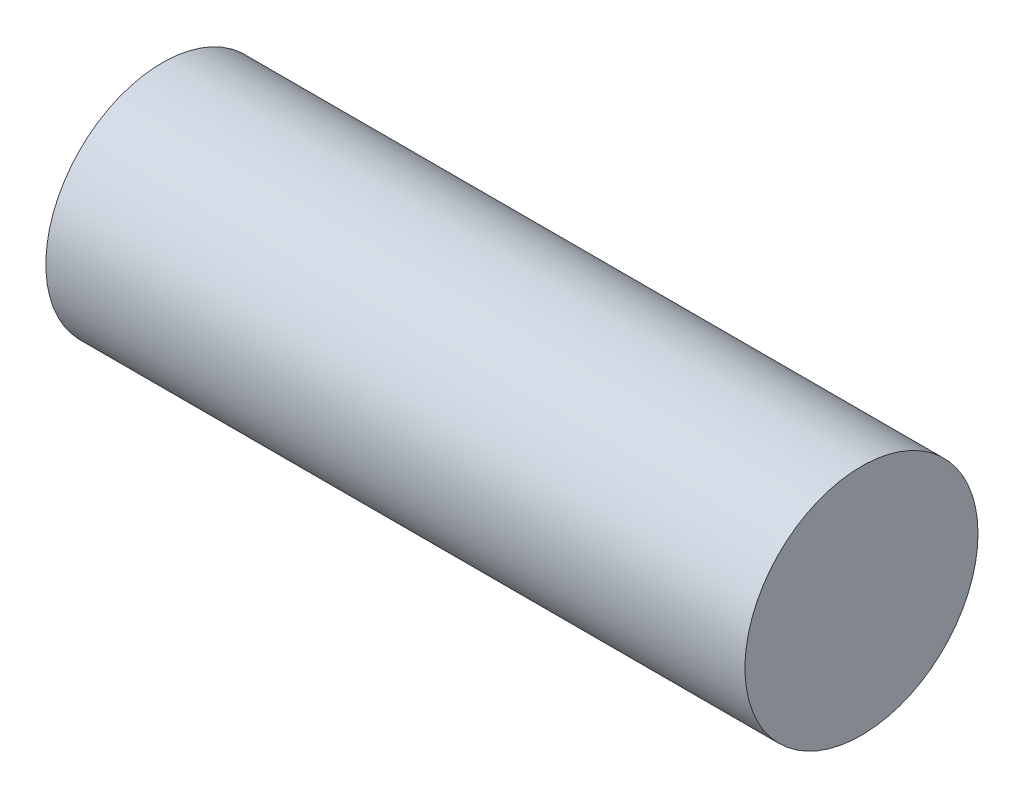
ISO-10303-21;
HEADER;
FILE_DESCRIPTION(('STEP AP214'),'2;1');
FILE_NAME('part.step','',(''),(''),'','','');
FILE_SCHEMA(('AUTOMOTIVE_DESIGN { 1 0 10303 214 1 1 1 1 }'));
ENDSEC;
DATA;
#1=APPLICATION_CONTEXT('core data for automotive mechanical design processes');
#2=APPLICATION_PROTOCOL_DEFINITION('international standard','automotive_design',2000,#1);
#3=PRODUCT_CONTEXT('',#1,'mechanical');
#4=PRODUCT('Part','Part','',(#3));
#5=PRODUCT_RELATED_PRODUCT_CATEGORY('part','',(#4));
#6=PRODUCT_DEFINITION_FORMATION('','',#4);
#7=PRODUCT_DEFINITION_CONTEXT('part definition',#1,'design');
#8=PRODUCT_DEFINITION('design','',#6,#7);
#9=PRODUCT_DEFINITION_SHAPE('','',#8);
#10=(LENGTH_UNIT() NAMED_UNIT(*) SI_UNIT(.MILLI.,.METRE.));
#11=(NAMED_UNIT(*) PLANE_ANGLE_UNIT() SI_UNIT($,.RADIAN.));
#12=(NAMED_UNIT(*) SI_UNIT($,.STERADIAN.) SOLID_ANGLE_UNIT());
#13=UNCERTAINTY_MEASURE_WITH_UNIT(LENGTH_MEASURE(1.E-05),#10,'distance_accuracy_value','');
#14=(GEOMETRIC_REPRESENTATION_CONTEXT(3) GLOBAL_UNCERTAINTY_ASSIGNED_CONTEXT((#13)) GLOBAL_UNIT_ASSIGNED_CONTEXT((#10,
#11,#12)) REPRESENTATION_CONTEXT('',''));
#15=CARTESIAN_POINT('',(0.,0.,0.));
#16=DIRECTION('',(0.,0.,1.));
#17=DIRECTION('',(1.,0.,0.));
#18=AXIS2_PLACEMENT_3D('',#15,#16,#17);
#19=CARTESIAN_POINT('',(30.,0.,0.));
#20=DIRECTION('',(-1.,0.,0.));
#21=DIRECTION('',(0.,0.,1.));
#22=AXIS2_PLACEMENT_3D('',#19,#20,#21);
#23=CYLINDRICAL_SURFACE('',#22,5.);
#24=CARTESIAN_POINT('',(30.,0.,0.));
#25=DIRECTION('',(1.,0.,0.));
#26=DIRECTION('',(0.,0.,-1.));
#27=AXIS2_PLACEMENT_3D('',#24,#25,#26);
#28=CIRCLE('',#27,5.);
#29=CARTESIAN_POINT('',(30.,0.,-5.));
#30=VERTEX_POINT('',#29);
#31=EDGE_CURVE('E10',#30,#30,#28,.T.);
#32=ORIENTED_EDGE('',*,*,#31,.F.);
#33=EDGE_LOOP('',(#32));
#34=FACE_BOUND('',#33,.T.);
#35=CARTESIAN_POINT('',(0.,0.,0.));
#36=DIRECTION('',(1.,0.,0.));
#37=DIRECTION('',(0.,0.,-1.));
#38=AXIS2_PLACEMENT_3D('',#35,#36,#37);
#39=CIRCLE('',#38,5.);
#40=CARTESIAN_POINT('',(0.,0.,-5.));
#41=VERTEX_POINT('',#40);
#42=EDGE_CURVE('E33',#41,#41,#39,.T.);
#43=ORIENTED_EDGE('',*,*,#42,.T.);
#44=EDGE_LOOP('',(#43));
#45=FACE_BOUND('',#44,.T.);
#46=ADVANCED_FACE('F30',(#34,#45),#23,.T.);
#47=CARTESIAN_POINT('',(30.,0.,0.));
#48=DIRECTION('',(1.,0.,0.));
#49=DIRECTION('',(0.,0.,-1.));
#50=AXIS2_PLACEMENT_3D('',#47,#48,#49);
#51=PLANE('',#50);
#52=ORIENTED_EDGE('',*,*,#31,.T.);
#53=EDGE_LOOP('',(#52));
#54=FACE_BOUND('',#53,.T.);
#55=ADVANCED_FACE('F45',(#54),#51,.T.);
#56=CARTESIAN_POINT('',(0.,0.,0.));
#57=DIRECTION('',(1.,0.,0.));
#58=DIRECTION('',(0.,0.,-1.));
#59=AXIS2_PLACEMENT_3D('',#56,#57,#58);
#60=PLANE('',#59);
#61=ORIENTED_EDGE('',*,*,#42,.F.);
#62=EDGE_LOOP('',(#61));
#63=FACE_BOUND('',#62,.T.);
#64=ADVANCED_FACE('F43',(#63),#60,.F.);
#65=CLOSED_SHELL('',(#46,#55,#64));
#66=MANIFOLD_SOLID_BREP('B2',#65);
#67=ADVANCED_BREP_SHAPE_REPRESENTATION('',(#18,#66),#14);
#68=SHAPE_DEFINITION_REPRESENTATION(#9,#67);
ENDSEC;
END-ISO-10303-21;
